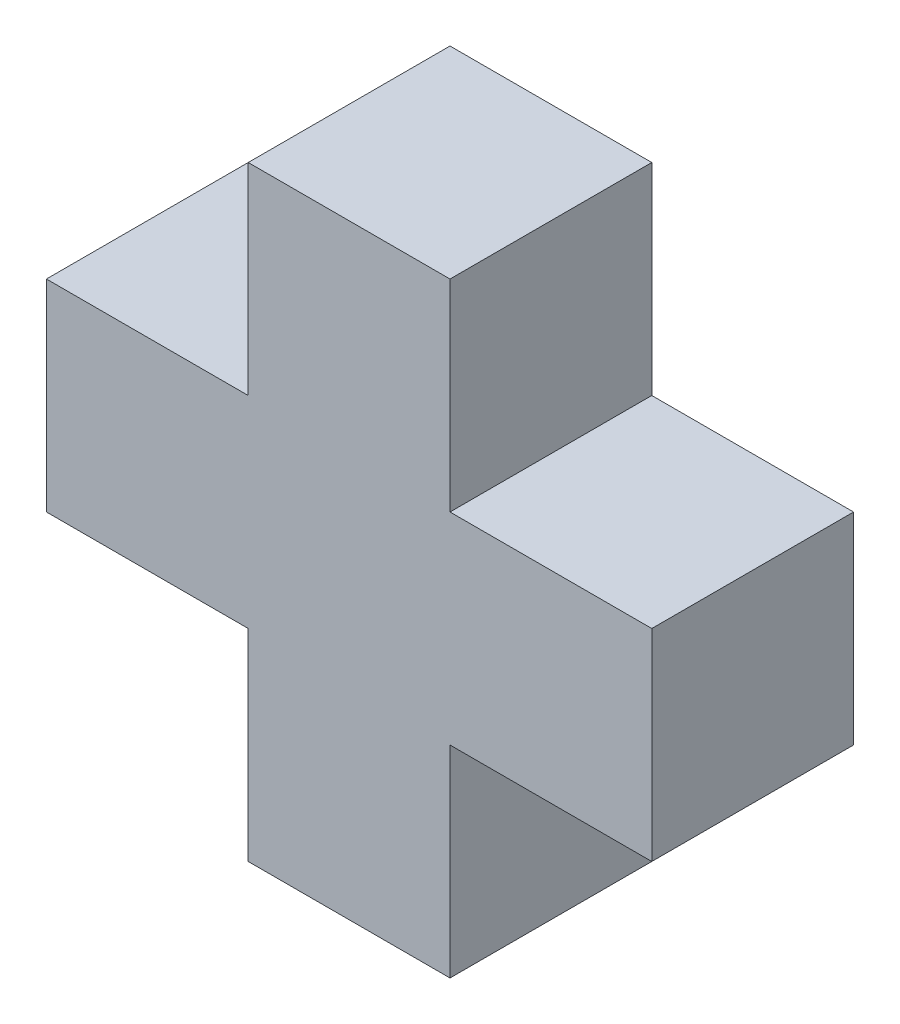
ISO-10303-21;
HEADER;
FILE_DESCRIPTION(('STEP AP214'),'2;1');
FILE_NAME('part.step','',(''),(''),'','','');
FILE_SCHEMA(('AUTOMOTIVE_DESIGN { 1 0 10303 214 1 1 1 1 }'));
ENDSEC;
DATA;
#1=APPLICATION_CONTEXT('core data for automotive mechanical design processes');
#2=APPLICATION_PROTOCOL_DEFINITION('international standard','automotive_design',2000,#1);
#3=PRODUCT_CONTEXT('',#1,'mechanical');
#4=PRODUCT('Part','Part','',(#3));
#5=PRODUCT_RELATED_PRODUCT_CATEGORY('part','',(#4));
#6=PRODUCT_DEFINITION_FORMATION('','',#4);
#7=PRODUCT_DEFINITION_CONTEXT('part definition',#1,'design');
#8=PRODUCT_DEFINITION('design','',#6,#7);
#9=PRODUCT_DEFINITION_SHAPE('','',#8);
#10=(LENGTH_UNIT() NAMED_UNIT(*) SI_UNIT(.MILLI.,.METRE.));
#11=(NAMED_UNIT(*) PLANE_ANGLE_UNIT() SI_UNIT($,.RADIAN.));
#12=(NAMED_UNIT(*) SI_UNIT($,.STERADIAN.) SOLID_ANGLE_UNIT());
#13=UNCERTAINTY_MEASURE_WITH_UNIT(LENGTH_MEASURE(1.E-05),#10,'distance_accuracy_value','');
#14=(GEOMETRIC_REPRESENTATION_CONTEXT(3) GLOBAL_UNCERTAINTY_ASSIGNED_CONTEXT((#13)) GLOBAL_UNIT_ASSIGNED_CONTEXT((#10,
#11,#12)) REPRESENTATION_CONTEXT('',''));
#15=CARTESIAN_POINT('',(0.,0.,0.));
#16=DIRECTION('',(0.,0.,1.));
#17=DIRECTION('',(1.,0.,0.));
#18=AXIS2_PLACEMENT_3D('',#15,#16,#17);
#19=CARTESIAN_POINT('',(50.8,0.,25.4));
#20=DIRECTION('',(0.,1.,0.));
#21=DIRECTION('',(0.,0.,1.));
#22=AXIS2_PLACEMENT_3D('',#19,#20,#21);
#23=PLANE('',#22);
#24=DIRECTION('',(1.,0.,0.));
#25=VECTOR('',#24,1.);
#26=CARTESIAN_POINT('',(50.8,0.,0.));
#27=LINE('',#26,#25);
#28=CARTESIAN_POINT('',(25.4,0.,0.));
#29=VERTEX_POINT('',#28);
#30=CARTESIAN_POINT('',(50.8,0.,0.));
#31=VERTEX_POINT('',#30);
#32=EDGE_CURVE('E158',#29,#31,#27,.T.);
#33=ORIENTED_EDGE('',*,*,#32,.T.);
#34=DIRECTION('',(0.,0.,-1.));
#35=VECTOR('',#34,1.);
#36=CARTESIAN_POINT('',(50.8,0.,25.4));
#37=LINE('',#36,#35);
#38=CARTESIAN_POINT('',(50.8,0.,25.4));
#39=VERTEX_POINT('',#38);
#40=EDGE_CURVE('E11',#39,#31,#37,.T.);
#41=ORIENTED_EDGE('',*,*,#40,.F.);
#42=DIRECTION('',(1.,0.,0.));
#43=VECTOR('',#42,1.);
#44=CARTESIAN_POINT('',(50.8,0.,25.4));
#45=LINE('',#44,#43);
#46=CARTESIAN_POINT('',(25.4,0.,25.4));
#47=VERTEX_POINT('',#46);
#48=EDGE_CURVE('E180',#47,#39,#45,.T.);
#49=ORIENTED_EDGE('',*,*,#48,.F.);
#50=DIRECTION('',(0.,0.,-1.));
#51=VECTOR('',#50,1.);
#52=CARTESIAN_POINT('',(25.4,0.,25.4));
#53=LINE('',#52,#51);
#54=EDGE_CURVE('E154',#47,#29,#53,.T.);
#55=ORIENTED_EDGE('',*,*,#54,.T.);
#56=EDGE_LOOP('',(#33,#41,#49,#55));
#57=FACE_BOUND('',#56,.T.);
#58=ADVANCED_FACE('F38',(#57),#23,.F.);
#59=CARTESIAN_POINT('',(50.8,25.4,25.4));
#60=DIRECTION('',(-1.,0.,0.));
#61=DIRECTION('',(0.,0.,1.));
#62=AXIS2_PLACEMENT_3D('',#59,#60,#61);
#63=PLANE('',#62);
#64=DIRECTION('',(0.,1.,0.));
#65=VECTOR('',#64,1.);
#66=CARTESIAN_POINT('',(50.8,25.4,0.));
#67=LINE('',#66,#65);
#68=CARTESIAN_POINT('',(50.8,25.4,0.));
#69=VERTEX_POINT('',#68);
#70=EDGE_CURVE('E161',#31,#69,#67,.T.);
#71=ORIENTED_EDGE('',*,*,#70,.T.);
#72=DIRECTION('',(0.,0.,-1.));
#73=VECTOR('',#72,1.);
#74=CARTESIAN_POINT('',(50.8,25.4,25.4));
#75=LINE('',#74,#73);
#76=CARTESIAN_POINT('',(50.8,25.4,25.4));
#77=VERTEX_POINT('',#76);
#78=EDGE_CURVE('E46',#77,#69,#75,.T.);
#79=ORIENTED_EDGE('',*,*,#78,.F.);
#80=DIRECTION('',(0.,1.,0.));
#81=VECTOR('',#80,1.);
#82=CARTESIAN_POINT('',(50.8,25.4,25.4));
#83=LINE('',#82,#81);
#84=EDGE_CURVE('E109',#39,#77,#83,.T.);
#85=ORIENTED_EDGE('',*,*,#84,.F.);
#86=ORIENTED_EDGE('',*,*,#40,.T.);
#87=EDGE_LOOP('',(#71,#79,#85,#86));
#88=FACE_BOUND('',#87,.T.);
#89=ADVANCED_FACE('F258',(#88),#63,.F.);
#90=CARTESIAN_POINT('',(76.2,25.4,25.4));
#91=DIRECTION('',(0.,1.,0.));
#92=DIRECTION('',(0.,0.,1.));
#93=AXIS2_PLACEMENT_3D('',#90,#91,#92);
#94=PLANE('',#93);
#95=DIRECTION('',(1.,0.,0.));
#96=VECTOR('',#95,1.);
#97=CARTESIAN_POINT('',(76.2,25.4,0.));
#98=LINE('',#97,#96);
#99=CARTESIAN_POINT('',(76.2,25.4,0.));
#100=VERTEX_POINT('',#99);
#101=EDGE_CURVE('E163',#69,#100,#98,.T.);
#102=ORIENTED_EDGE('',*,*,#101,.T.);
#103=DIRECTION('',(0.,0.,-1.));
#104=VECTOR('',#103,1.);
#105=CARTESIAN_POINT('',(76.2,25.4,25.4));
#106=LINE('',#105,#104);
#107=CARTESIAN_POINT('',(76.2,25.4,25.4));
#108=VERTEX_POINT('',#107);
#109=EDGE_CURVE('E199',#108,#100,#106,.T.);
#110=ORIENTED_EDGE('',*,*,#109,.F.);
#111=DIRECTION('',(1.,0.,0.));
#112=VECTOR('',#111,1.);
#113=CARTESIAN_POINT('',(76.2,25.4,25.4));
#114=LINE('',#113,#112);
#115=EDGE_CURVE('E207',#77,#108,#114,.T.);
#116=ORIENTED_EDGE('',*,*,#115,.F.);
#117=ORIENTED_EDGE('',*,*,#78,.T.);
#118=EDGE_LOOP('',(#102,#110,#116,#117));
#119=FACE_BOUND('',#118,.T.);
#120=ADVANCED_FACE('F205',(#119),#94,.F.);
#121=CARTESIAN_POINT('',(76.2,50.8,25.4));
#122=DIRECTION('',(-1.,0.,0.));
#123=DIRECTION('',(0.,0.,1.));
#124=AXIS2_PLACEMENT_3D('',#121,#122,#123);
#125=PLANE('',#124);
#126=DIRECTION('',(0.,1.,0.));
#127=VECTOR('',#126,1.);
#128=CARTESIAN_POINT('',(76.2,50.8,0.));
#129=LINE('',#128,#127);
#130=CARTESIAN_POINT('',(76.2,50.8,0.));
#131=VERTEX_POINT('',#130);
#132=EDGE_CURVE('E165',#100,#131,#129,.T.);
#133=ORIENTED_EDGE('',*,*,#132,.T.);
#134=DIRECTION('',(0.,0.,-1.));
#135=VECTOR('',#134,1.);
#136=CARTESIAN_POINT('',(76.2,50.8,25.4));
#137=LINE('',#136,#135);
#138=CARTESIAN_POINT('',(76.2,50.8,25.4));
#139=VERTEX_POINT('',#138);
#140=EDGE_CURVE('E196',#139,#131,#137,.T.);
#141=ORIENTED_EDGE('',*,*,#140,.F.);
#142=DIRECTION('',(0.,1.,0.));
#143=VECTOR('',#142,1.);
#144=CARTESIAN_POINT('',(76.2,50.8,25.4));
#145=LINE('',#144,#143);
#146=EDGE_CURVE('E225',#108,#139,#145,.T.);
#147=ORIENTED_EDGE('',*,*,#146,.F.);
#148=ORIENTED_EDGE('',*,*,#109,.T.);
#149=EDGE_LOOP('',(#133,#141,#147,#148));
#150=FACE_BOUND('',#149,.T.);
#151=ADVANCED_FACE('F216',(#150),#125,.F.);
#152=CARTESIAN_POINT('',(50.8,50.8,25.4));
#153=DIRECTION('',(0.,-1.,0.));
#154=DIRECTION('',(0.,0.,-1.));
#155=AXIS2_PLACEMENT_3D('',#152,#153,#154);
#156=PLANE('',#155);
#157=DIRECTION('',(-1.,0.,0.));
#158=VECTOR('',#157,1.);
#159=CARTESIAN_POINT('',(50.8,50.8,0.));
#160=LINE('',#159,#158);
#161=CARTESIAN_POINT('',(50.8,50.8,0.));
#162=VERTEX_POINT('',#161);
#163=EDGE_CURVE('E167',#131,#162,#160,.T.);
#164=ORIENTED_EDGE('',*,*,#163,.T.);
#165=DIRECTION('',(0.,0.,-1.));
#166=VECTOR('',#165,1.);
#167=CARTESIAN_POINT('',(50.8,50.8,25.4));
#168=LINE('',#167,#166);
#169=CARTESIAN_POINT('',(50.8,50.8,25.4));
#170=VERTEX_POINT('',#169);
#171=EDGE_CURVE('E193',#170,#162,#168,.T.);
#172=ORIENTED_EDGE('',*,*,#171,.F.);
#173=DIRECTION('',(-1.,0.,0.));
#174=VECTOR('',#173,1.);
#175=CARTESIAN_POINT('',(50.8,50.8,25.4));
#176=LINE('',#175,#174);
#177=EDGE_CURVE('E222',#139,#170,#176,.T.);
#178=ORIENTED_EDGE('',*,*,#177,.F.);
#179=ORIENTED_EDGE('',*,*,#140,.T.);
#180=EDGE_LOOP('',(#164,#172,#178,#179));
#181=FACE_BOUND('',#180,.T.);
#182=ADVANCED_FACE('F220',(#181),#156,.F.);
#183=CARTESIAN_POINT('',(50.8,76.2,25.4));
#184=DIRECTION('',(-1.,0.,0.));
#185=DIRECTION('',(0.,0.,1.));
#186=AXIS2_PLACEMENT_3D('',#183,#184,#185);
#187=PLANE('',#186);
#188=DIRECTION('',(0.,1.,0.));
#189=VECTOR('',#188,1.);
#190=CARTESIAN_POINT('',(50.8,76.2,0.));
#191=LINE('',#190,#189);
#192=CARTESIAN_POINT('',(50.8,76.2,0.));
#193=VERTEX_POINT('',#192);
#194=EDGE_CURVE('E169',#162,#193,#191,.T.);
#195=ORIENTED_EDGE('',*,*,#194,.T.);
#196=DIRECTION('',(0.,0.,-1.));
#197=VECTOR('',#196,1.);
#198=CARTESIAN_POINT('',(50.8,76.2,25.4));
#199=LINE('',#198,#197);
#200=CARTESIAN_POINT('',(50.8,76.2,25.4));
#201=VERTEX_POINT('',#200);
#202=EDGE_CURVE('E190',#201,#193,#199,.T.);
#203=ORIENTED_EDGE('',*,*,#202,.F.);
#204=DIRECTION('',(0.,1.,0.));
#205=VECTOR('',#204,1.);
#206=CARTESIAN_POINT('',(50.8,76.2,25.4));
#207=LINE('',#206,#205);
#208=EDGE_CURVE('E224',#170,#201,#207,.T.);
#209=ORIENTED_EDGE('',*,*,#208,.F.);
#210=ORIENTED_EDGE('',*,*,#171,.T.);
#211=EDGE_LOOP('',(#195,#203,#209,#210));
#212=FACE_BOUND('',#211,.T.);
#213=ADVANCED_FACE('F271',(#212),#187,.F.);
#214=CARTESIAN_POINT('',(25.4,76.2,25.4));
#215=DIRECTION('',(0.,-1.,0.));
#216=DIRECTION('',(0.,0.,-1.));
#217=AXIS2_PLACEMENT_3D('',#214,#215,#216);
#218=PLANE('',#217);
#219=DIRECTION('',(-1.,0.,0.));
#220=VECTOR('',#219,1.);
#221=CARTESIAN_POINT('',(25.4,76.2,0.));
#222=LINE('',#221,#220);
#223=CARTESIAN_POINT('',(25.4,76.2,0.));
#224=VERTEX_POINT('',#223);
#225=EDGE_CURVE('E171',#193,#224,#222,.T.);
#226=ORIENTED_EDGE('',*,*,#225,.T.);
#227=DIRECTION('',(0.,0.,-1.));
#228=VECTOR('',#227,1.);
#229=CARTESIAN_POINT('',(25.4,76.2,25.4));
#230=LINE('',#229,#228);
#231=CARTESIAN_POINT('',(25.4,76.2,25.4));
#232=VERTEX_POINT('',#231);
#233=EDGE_CURVE('E187',#232,#224,#230,.T.);
#234=ORIENTED_EDGE('',*,*,#233,.F.);
#235=DIRECTION('',(-1.,0.,0.));
#236=VECTOR('',#235,1.);
#237=CARTESIAN_POINT('',(25.4,76.2,25.4));
#238=LINE('',#237,#236);
#239=EDGE_CURVE('E227',#201,#232,#238,.T.);
#240=ORIENTED_EDGE('',*,*,#239,.F.);
#241=ORIENTED_EDGE('',*,*,#202,.T.);
#242=EDGE_LOOP('',(#226,#234,#240,#241));
#243=FACE_BOUND('',#242,.T.);
#244=ADVANCED_FACE('F274',(#243),#218,.F.);
#245=CARTESIAN_POINT('',(25.4,50.8,25.4));
#246=DIRECTION('',(1.,0.,0.));
#247=DIRECTION('',(0.,0.,-1.));
#248=AXIS2_PLACEMENT_3D('',#245,#246,#247);
#249=PLANE('',#248);
#250=DIRECTION('',(0.,-1.,0.));
#251=VECTOR('',#250,1.);
#252=CARTESIAN_POINT('',(25.4,50.8,0.));
#253=LINE('',#252,#251);
#254=CARTESIAN_POINT('',(25.4,50.8,0.));
#255=VERTEX_POINT('',#254);
#256=EDGE_CURVE('E173',#224,#255,#253,.T.);
#257=ORIENTED_EDGE('',*,*,#256,.T.);
#258=DIRECTION('',(0.,0.,-1.));
#259=VECTOR('',#258,1.);
#260=CARTESIAN_POINT('',(25.4,50.8,25.4));
#261=LINE('',#260,#259);
#262=CARTESIAN_POINT('',(25.4,50.8,25.4));
#263=VERTEX_POINT('',#262);
#264=EDGE_CURVE('E184',#263,#255,#261,.T.);
#265=ORIENTED_EDGE('',*,*,#264,.F.);
#266=DIRECTION('',(0.,-1.,0.));
#267=VECTOR('',#266,1.);
#268=CARTESIAN_POINT('',(25.4,50.8,25.4));
#269=LINE('',#268,#267);
#270=EDGE_CURVE('E233',#232,#263,#269,.T.);
#271=ORIENTED_EDGE('',*,*,#270,.F.);
#272=ORIENTED_EDGE('',*,*,#233,.T.);
#273=EDGE_LOOP('',(#257,#265,#271,#272));
#274=FACE_BOUND('',#273,.T.);
#275=ADVANCED_FACE('F239',(#274),#249,.F.);
#276=CARTESIAN_POINT('',(0.,50.8,25.4));
#277=DIRECTION('',(0.,-1.,0.));
#278=DIRECTION('',(0.,0.,-1.));
#279=AXIS2_PLACEMENT_3D('',#276,#277,#278);
#280=PLANE('',#279);
#281=DIRECTION('',(-1.,0.,0.));
#282=VECTOR('',#281,1.);
#283=CARTESIAN_POINT('',(0.,50.8,0.));
#284=LINE('',#283,#282);
#285=CARTESIAN_POINT('',(0.,50.8,0.));
#286=VERTEX_POINT('',#285);
#287=EDGE_CURVE('E175',#255,#286,#284,.T.);
#288=ORIENTED_EDGE('',*,*,#287,.T.);
#289=DIRECTION('',(0.,0.,-1.));
#290=VECTOR('',#289,1.);
#291=CARTESIAN_POINT('',(0.,50.8,25.4));
#292=LINE('',#291,#290);
#293=CARTESIAN_POINT('',(0.,50.8,25.4));
#294=VERTEX_POINT('',#293);
#295=EDGE_CURVE('E149',#294,#286,#292,.T.);
#296=ORIENTED_EDGE('',*,*,#295,.F.);
#297=DIRECTION('',(-1.,0.,0.));
#298=VECTOR('',#297,1.);
#299=CARTESIAN_POINT('',(0.,50.8,25.4));
#300=LINE('',#299,#298);
#301=EDGE_CURVE('E140',#263,#294,#300,.T.);
#302=ORIENTED_EDGE('',*,*,#301,.F.);
#303=ORIENTED_EDGE('',*,*,#264,.T.);
#304=EDGE_LOOP('',(#288,#296,#302,#303));
#305=FACE_BOUND('',#304,.T.);
#306=ADVANCED_FACE('F243',(#305),#280,.F.);
#307=CARTESIAN_POINT('',(0.,25.4,25.4));
#308=DIRECTION('',(1.,0.,0.));
#309=DIRECTION('',(0.,0.,-1.));
#310=AXIS2_PLACEMENT_3D('',#307,#308,#309);
#311=PLANE('',#310);
#312=DIRECTION('',(0.,-1.,0.));
#313=VECTOR('',#312,1.);
#314=CARTESIAN_POINT('',(0.,25.4,0.));
#315=LINE('',#314,#313);
#316=CARTESIAN_POINT('',(0.,25.4,0.));
#317=VERTEX_POINT('',#316);
#318=EDGE_CURVE('E148',#286,#317,#315,.T.);
#319=ORIENTED_EDGE('',*,*,#318,.T.);
#320=DIRECTION('',(0.,0.,-1.));
#321=VECTOR('',#320,1.);
#322=CARTESIAN_POINT('',(0.,25.4,25.4));
#323=LINE('',#322,#321);
#324=CARTESIAN_POINT('',(0.,25.4,25.4));
#325=VERTEX_POINT('',#324);
#326=EDGE_CURVE('E145',#325,#317,#323,.T.);
#327=ORIENTED_EDGE('',*,*,#326,.F.);
#328=DIRECTION('',(0.,-1.,0.));
#329=VECTOR('',#328,1.);
#330=CARTESIAN_POINT('',(0.,25.4,25.4));
#331=LINE('',#330,#329);
#332=EDGE_CURVE('E134',#294,#325,#331,.T.);
#333=ORIENTED_EDGE('',*,*,#332,.F.);
#334=ORIENTED_EDGE('',*,*,#295,.T.);
#335=EDGE_LOOP('',(#319,#327,#333,#334));
#336=FACE_BOUND('',#335,.T.);
#337=ADVANCED_FACE('F146',(#336),#311,.F.);
#338=CARTESIAN_POINT('',(25.4,25.4,25.4));
#339=DIRECTION('',(0.,1.,0.));
#340=DIRECTION('',(0.,0.,1.));
#341=AXIS2_PLACEMENT_3D('',#338,#339,#340);
#342=PLANE('',#341);
#343=DIRECTION('',(1.,0.,0.));
#344=VECTOR('',#343,1.);
#345=CARTESIAN_POINT('',(25.4,25.4,0.));
#346=LINE('',#345,#344);
#347=CARTESIAN_POINT('',(25.4,25.4,0.));
#348=VERTEX_POINT('',#347);
#349=EDGE_CURVE('E95',#317,#348,#346,.T.);
#350=ORIENTED_EDGE('',*,*,#349,.T.);
#351=DIRECTION('',(0.,0.,-1.));
#352=VECTOR('',#351,1.);
#353=CARTESIAN_POINT('',(25.4,25.4,25.4));
#354=LINE('',#353,#352);
#355=CARTESIAN_POINT('',(25.4,25.4,25.4));
#356=VERTEX_POINT('',#355);
#357=EDGE_CURVE('E150',#356,#348,#354,.T.);
#358=ORIENTED_EDGE('',*,*,#357,.F.);
#359=DIRECTION('',(1.,0.,0.));
#360=VECTOR('',#359,1.);
#361=CARTESIAN_POINT('',(25.4,25.4,25.4));
#362=LINE('',#361,#360);
#363=EDGE_CURVE('E138',#325,#356,#362,.T.);
#364=ORIENTED_EDGE('',*,*,#363,.F.);
#365=ORIENTED_EDGE('',*,*,#326,.T.);
#366=EDGE_LOOP('',(#350,#358,#364,#365));
#367=FACE_BOUND('',#366,.T.);
#368=ADVANCED_FACE('F152',(#367),#342,.F.);
#369=CARTESIAN_POINT('',(25.4,0.,25.4));
#370=DIRECTION('',(1.,0.,0.));
#371=DIRECTION('',(0.,0.,-1.));
#372=AXIS2_PLACEMENT_3D('',#369,#370,#371);
#373=PLANE('',#372);
#374=DIRECTION('',(0.,-1.,0.));
#375=VECTOR('',#374,1.);
#376=CARTESIAN_POINT('',(25.4,0.,0.));
#377=LINE('',#376,#375);
#378=EDGE_CURVE('E101',#348,#29,#377,.T.);
#379=ORIENTED_EDGE('',*,*,#378,.T.);
#380=ORIENTED_EDGE('',*,*,#54,.F.);
#381=DIRECTION('',(0.,-1.,0.));
#382=VECTOR('',#381,1.);
#383=CARTESIAN_POINT('',(25.4,0.,25.4));
#384=LINE('',#383,#382);
#385=EDGE_CURVE('E54',#356,#47,#384,.T.);
#386=ORIENTED_EDGE('',*,*,#385,.F.);
#387=ORIENTED_EDGE('',*,*,#357,.T.);
#388=EDGE_LOOP('',(#379,#380,#386,#387));
#389=FACE_BOUND('',#388,.T.);
#390=ADVANCED_FACE('F247',(#389),#373,.F.);
#391=CARTESIAN_POINT('',(0.,0.,25.4));
#392=DIRECTION('',(0.,0.,-1.));
#393=DIRECTION('',(-1.,0.,0.));
#394=AXIS2_PLACEMENT_3D('',#391,#392,#393);
#395=PLANE('',#394);
#396=ORIENTED_EDGE('',*,*,#48,.T.);
#397=ORIENTED_EDGE('',*,*,#84,.T.);
#398=ORIENTED_EDGE('',*,*,#115,.T.);
#399=ORIENTED_EDGE('',*,*,#146,.T.);
#400=ORIENTED_EDGE('',*,*,#177,.T.);
#401=ORIENTED_EDGE('',*,*,#208,.T.);
#402=ORIENTED_EDGE('',*,*,#239,.T.);
#403=ORIENTED_EDGE('',*,*,#270,.T.);
#404=ORIENTED_EDGE('',*,*,#301,.T.);
#405=ORIENTED_EDGE('',*,*,#332,.T.);
#406=ORIENTED_EDGE('',*,*,#363,.T.);
#407=ORIENTED_EDGE('',*,*,#385,.T.);
#408=EDGE_LOOP('',(#396,#397,#398,#399,#400,#401,#402,#403,#404,#405,#406,#407));
#409=FACE_BOUND('',#408,.T.);
#410=ADVANCED_FACE('F136',(#409),#395,.F.);
#411=CARTESIAN_POINT('',(0.,0.,0.));
#412=DIRECTION('',(0.,0.,-1.));
#413=DIRECTION('',(-1.,0.,0.));
#414=AXIS2_PLACEMENT_3D('',#411,#412,#413);
#415=PLANE('',#414);
#416=ORIENTED_EDGE('',*,*,#32,.F.);
#417=ORIENTED_EDGE('',*,*,#378,.F.);
#418=ORIENTED_EDGE('',*,*,#349,.F.);
#419=ORIENTED_EDGE('',*,*,#318,.F.);
#420=ORIENTED_EDGE('',*,*,#287,.F.);
#421=ORIENTED_EDGE('',*,*,#256,.F.);
#422=ORIENTED_EDGE('',*,*,#225,.F.);
#423=ORIENTED_EDGE('',*,*,#194,.F.);
#424=ORIENTED_EDGE('',*,*,#163,.F.);
#425=ORIENTED_EDGE('',*,*,#132,.F.);
#426=ORIENTED_EDGE('',*,*,#101,.F.);
#427=ORIENTED_EDGE('',*,*,#70,.F.);
#428=EDGE_LOOP('',(#416,#417,#418,#419,#420,#421,#422,#423,#424,#425,#426,#427));
#429=FACE_BOUND('',#428,.T.);
#430=ADVANCED_FACE('F211',(#429),#415,.T.);
#431=CLOSED_SHELL('',(#58,#89,#120,#151,#182,#213,#244,#275,#306,#337,#368,#390,#410,#430));
#432=MANIFOLD_SOLID_BREP('B2',#431);
#433=ADVANCED_BREP_SHAPE_REPRESENTATION('',(#18,#432),#14);
#434=SHAPE_DEFINITION_REPRESENTATION(#9,#433);
ENDSEC;
END-ISO-10303-21;
